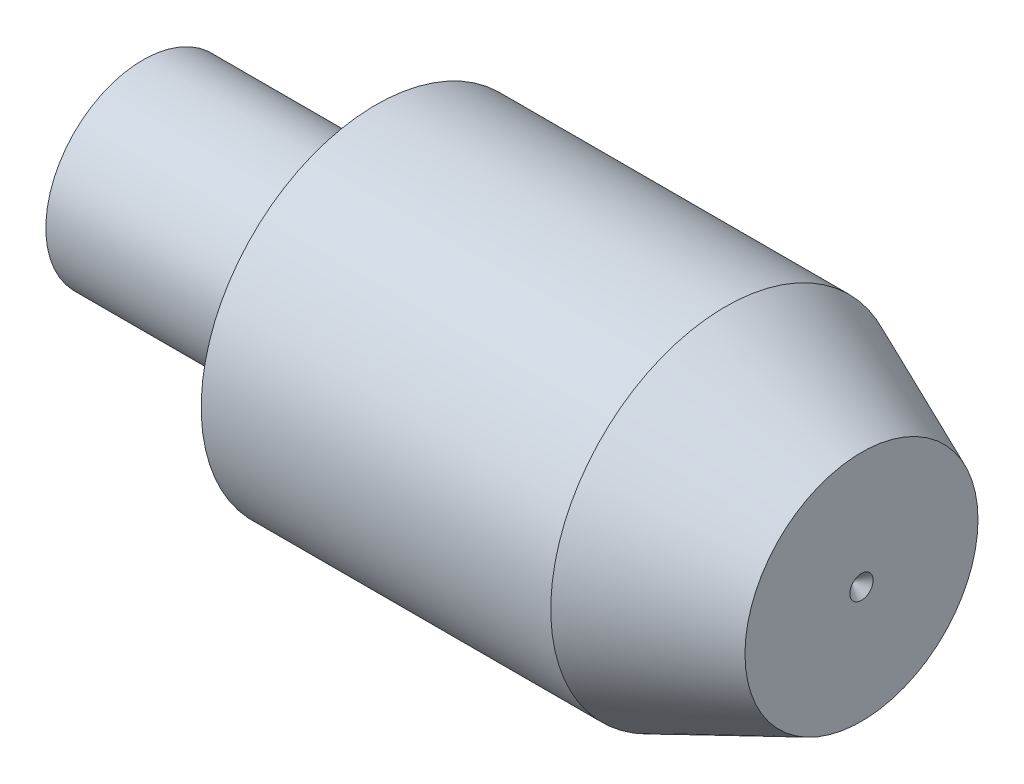
ISO-10303-21;
HEADER;
FILE_DESCRIPTION(('STEP AP214'),'2;1');
FILE_NAME('part.step','',(''),(''),'','','');
FILE_SCHEMA(('AUTOMOTIVE_DESIGN { 1 0 10303 214 1 1 1 1 }'));
ENDSEC;
DATA;
#1=APPLICATION_CONTEXT('core data for automotive mechanical design processes');
#2=APPLICATION_PROTOCOL_DEFINITION('international standard','automotive_design',2000,#1);
#3=PRODUCT_CONTEXT('',#1,'mechanical');
#4=PRODUCT('Part','Part','',(#3));
#5=PRODUCT_RELATED_PRODUCT_CATEGORY('part','',(#4));
#6=PRODUCT_DEFINITION_FORMATION('','',#4);
#7=PRODUCT_DEFINITION_CONTEXT('part definition',#1,'design');
#8=PRODUCT_DEFINITION('design','',#6,#7);
#9=PRODUCT_DEFINITION_SHAPE('','',#8);
#10=(LENGTH_UNIT() NAMED_UNIT(*) SI_UNIT(.MILLI.,.METRE.));
#11=(NAMED_UNIT(*) PLANE_ANGLE_UNIT() SI_UNIT($,.RADIAN.));
#12=(NAMED_UNIT(*) SI_UNIT($,.STERADIAN.) SOLID_ANGLE_UNIT());
#13=UNCERTAINTY_MEASURE_WITH_UNIT(LENGTH_MEASURE(1.E-05),#10,'distance_accuracy_value','');
#14=(GEOMETRIC_REPRESENTATION_CONTEXT(3) GLOBAL_UNCERTAINTY_ASSIGNED_CONTEXT((#13)) GLOBAL_UNIT_ASSIGNED_CONTEXT((#10,
#11,#12)) REPRESENTATION_CONTEXT('',''));
#15=CARTESIAN_POINT('',(0.,0.,0.));
#16=DIRECTION('',(0.,0.,1.));
#17=DIRECTION('',(1.,0.,0.));
#18=AXIS2_PLACEMENT_3D('',#15,#16,#17);
#19=CARTESIAN_POINT('',(-12.,5.,0.));
#20=DIRECTION('',(-1.,0.,0.));
#21=DIRECTION('',(0.,0.,1.));
#22=AXIS2_PLACEMENT_3D('',#19,#20,#21);
#23=PLANE('',#22);
#24=CARTESIAN_POINT('',(-12.,0.,0.));
#25=DIRECTION('',(1.,0.,0.));
#26=DIRECTION('',(0.,0.,-1.));
#27=AXIS2_PLACEMENT_3D('',#24,#25,#26);
#28=CIRCLE('',#27,5.);
#29=CARTESIAN_POINT('',(-12.,0.,-5.));
#30=VERTEX_POINT('',#29);
#31=EDGE_CURVE('E11',#30,#30,#28,.T.);
#32=ORIENTED_EDGE('',*,*,#31,.F.);
#33=EDGE_LOOP('',(#32));
#34=FACE_BOUND('',#33,.T.);
#35=ADVANCED_FACE('F36',(#34),#23,.T.);
#36=CARTESIAN_POINT('',(25.,0.,0.));
#37=DIRECTION('',(1.,0.,0.));
#38=DIRECTION('',(0.,0.,-1.));
#39=AXIS2_PLACEMENT_3D('',#36,#37,#38);
#40=CYLINDRICAL_SURFACE('',#39,5.);
#41=ORIENTED_EDGE('',*,*,#31,.T.);
#42=EDGE_LOOP('',(#41));
#43=FACE_BOUND('',#42,.T.);
#44=CARTESIAN_POINT('',(0.,0.,0.));
#45=DIRECTION('',(1.,0.,0.));
#46=DIRECTION('',(0.,0.,-1.));
#47=AXIS2_PLACEMENT_3D('',#44,#45,#46);
#48=CIRCLE('',#47,5.00000000000001);
#49=CARTESIAN_POINT('',(0.,0.,-5.00000000000001));
#50=VERTEX_POINT('',#49);
#51=EDGE_CURVE('E42',#50,#50,#48,.T.);
#52=ORIENTED_EDGE('',*,*,#51,.F.);
#53=EDGE_LOOP('',(#52));
#54=FACE_BOUND('',#53,.T.);
#55=ADVANCED_FACE('F70',(#43,#54),#40,.T.);
#56=CARTESIAN_POINT('',(0.,5.00000000000001,0.));
#57=DIRECTION('',(-1.,0.,0.));
#58=DIRECTION('',(0.,0.,1.));
#59=AXIS2_PLACEMENT_3D('',#56,#57,#58);
#60=PLANE('',#59);
#61=ORIENTED_EDGE('',*,*,#51,.T.);
#62=EDGE_LOOP('',(#61));
#63=FACE_BOUND('',#62,.T.);
#64=CARTESIAN_POINT('',(0.,0.,0.));
#65=DIRECTION('',(1.,0.,0.));
#66=DIRECTION('',(0.,0.,-1.));
#67=AXIS2_PLACEMENT_3D('',#64,#65,#66);
#68=CIRCLE('',#67,9.);
#69=CARTESIAN_POINT('',(0.,0.,-9.));
#70=VERTEX_POINT('',#69);
#71=EDGE_CURVE('E62',#70,#70,#68,.T.);
#72=ORIENTED_EDGE('',*,*,#71,.F.);
#73=EDGE_LOOP('',(#72));
#74=FACE_BOUND('',#73,.T.);
#75=ADVANCED_FACE('F67',(#63,#74),#60,.T.);
#76=CARTESIAN_POINT('',(25.,0.,0.));
#77=DIRECTION('',(1.,0.,0.));
#78=DIRECTION('',(0.,0.,-1.));
#79=AXIS2_PLACEMENT_3D('',#76,#77,#78);
#80=CYLINDRICAL_SURFACE('',#79,9.);
#81=ORIENTED_EDGE('',*,*,#71,.T.);
#82=EDGE_LOOP('',(#81));
#83=FACE_BOUND('',#82,.T.);
#84=CARTESIAN_POINT('',(18.,0.,0.));
#85=DIRECTION('',(1.,0.,0.));
#86=DIRECTION('',(0.,0.,-1.));
#87=AXIS2_PLACEMENT_3D('',#84,#85,#86);
#88=CIRCLE('',#87,9.);
#89=CARTESIAN_POINT('',(18.,0.,-9.));
#90=VERTEX_POINT('',#89);
#91=EDGE_CURVE('E57',#90,#90,#88,.T.);
#92=ORIENTED_EDGE('',*,*,#91,.F.);
#93=EDGE_LOOP('',(#92));
#94=FACE_BOUND('',#93,.T.);
#95=ADVANCED_FACE('F77',(#83,#94),#80,.T.);
#96=CARTESIAN_POINT('',(25.,0.,0.));
#97=DIRECTION('',(-1.,0.,0.));
#98=DIRECTION('',(0.,0.,1.));
#99=AXIS2_PLACEMENT_3D('',#96,#97,#98);
#100=CONICAL_SURFACE('',#99,6.,0.404891786285083);
#101=ORIENTED_EDGE('',*,*,#91,.T.);
#102=EDGE_LOOP('',(#101));
#103=FACE_BOUND('',#102,.T.);
#104=CARTESIAN_POINT('',(25.,0.,0.));
#105=DIRECTION('',(1.,0.,0.));
#106=DIRECTION('',(0.,0.,-1.));
#107=AXIS2_PLACEMENT_3D('',#104,#105,#106);
#108=CIRCLE('',#107,6.);
#109=CARTESIAN_POINT('',(25.,0.,-6.));
#110=VERTEX_POINT('',#109);
#111=EDGE_CURVE('E54',#110,#110,#108,.T.);
#112=ORIENTED_EDGE('',*,*,#111,.F.);
#113=EDGE_LOOP('',(#112));
#114=FACE_BOUND('',#113,.T.);
#115=ADVANCED_FACE('F83',(#103,#114),#100,.T.);
#116=CARTESIAN_POINT('',(25.,6.,0.));
#117=DIRECTION('',(1.,0.,0.));
#118=DIRECTION('',(0.,0.,-1.));
#119=AXIS2_PLACEMENT_3D('',#116,#117,#118);
#120=PLANE('',#119);
#121=CARTESIAN_POINT('',(25.,0.,0.));
#122=DIRECTION('',(1.,0.,0.));
#123=DIRECTION('',(0.,0.,-1.));
#124=AXIS2_PLACEMENT_3D('',#121,#122,#123);
#125=CIRCLE('',#124,0.6);
#126=CARTESIAN_POINT('',(25.,0.,-0.6));
#127=VERTEX_POINT('',#126);
#128=EDGE_CURVE('E52',#127,#127,#125,.T.);
#129=ORIENTED_EDGE('',*,*,#128,.F.);
#130=EDGE_LOOP('',(#129));
#131=FACE_BOUND('',#130,.T.);
#132=ORIENTED_EDGE('',*,*,#111,.T.);
#133=EDGE_LOOP('',(#132));
#134=FACE_BOUND('',#133,.T.);
#135=ADVANCED_FACE('F48',(#131,#134),#120,.T.);
#136=CARTESIAN_POINT('',(25.,0.,0.));
#137=DIRECTION('',(1.,0.,0.));
#138=DIRECTION('',(0.,0.,-1.));
#139=AXIS2_PLACEMENT_3D('',#136,#137,#138);
#140=CONICAL_SURFACE('',#139,0.6,0.78539816339745);
#141=CARTESIAN_POINT('',(24.4,0.,0.));
#142=VERTEX_POINT('',#141);
#143=VERTEX_LOOP('',#142);
#144=FACE_BOUND('',#143,.T.);
#145=ORIENTED_EDGE('',*,*,#128,.T.);
#146=EDGE_LOOP('',(#145));
#147=FACE_BOUND('',#146,.T.);
#148=ADVANCED_FACE('F45',(#144,#147),#140,.F.);
#149=CLOSED_SHELL('',(#35,#55,#75,#95,#115,#135,#148));
#150=MANIFOLD_SOLID_BREP('B2',#149);
#151=ADVANCED_BREP_SHAPE_REPRESENTATION('',(#18,#150),#14);
#152=SHAPE_DEFINITION_REPRESENTATION(#9,#151);
ENDSEC;
END-ISO-10303-21;
